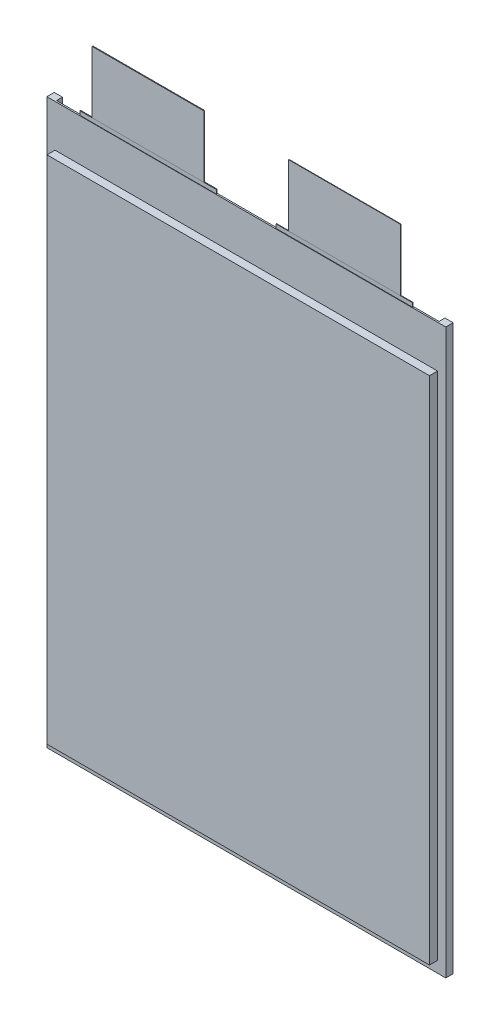
ISO-10303-21;
HEADER;
FILE_DESCRIPTION(('STEP AP214'),'2;1');
FILE_NAME('part.step','',(''),(''),'','','');
FILE_SCHEMA(('AUTOMOTIVE_DESIGN { 1 0 10303 214 1 1 1 1 }'));
ENDSEC;
DATA;
#1=APPLICATION_CONTEXT('core data for automotive mechanical design processes');
#2=APPLICATION_PROTOCOL_DEFINITION('international standard','automotive_design',2000,#1);
#3=PRODUCT_CONTEXT('',#1,'mechanical');
#4=PRODUCT('Part','Part','',(#3));
#5=PRODUCT_RELATED_PRODUCT_CATEGORY('part','',(#4));
#6=PRODUCT_DEFINITION_FORMATION('','',#4);
#7=PRODUCT_DEFINITION_CONTEXT('part definition',#1,'design');
#8=PRODUCT_DEFINITION('design','',#6,#7);
#9=PRODUCT_DEFINITION_SHAPE('','',#8);
#10=(LENGTH_UNIT() NAMED_UNIT(*) SI_UNIT(.MILLI.,.METRE.));
#11=(NAMED_UNIT(*) PLANE_ANGLE_UNIT() SI_UNIT($,.RADIAN.));
#12=(NAMED_UNIT(*) SI_UNIT($,.STERADIAN.) SOLID_ANGLE_UNIT());
#13=UNCERTAINTY_MEASURE_WITH_UNIT(LENGTH_MEASURE(1.E-05),#10,'distance_accuracy_value','');
#14=(GEOMETRIC_REPRESENTATION_CONTEXT(3) GLOBAL_UNCERTAINTY_ASSIGNED_CONTEXT((#13)) GLOBAL_UNIT_ASSIGNED_CONTEXT((#10,
#11,#12)) REPRESENTATION_CONTEXT('',''));
#15=CARTESIAN_POINT('',(0.,0.,0.));
#16=DIRECTION('',(0.,0.,1.));
#17=DIRECTION('',(1.,0.,0.));
#18=AXIS2_PLACEMENT_3D('',#15,#16,#17);
#19=CARTESIAN_POINT('',(-17.2,140.,0.150000000000002));
#20=DIRECTION('',(0.,0.,-1.));
#21=DIRECTION('',(0.,1.,0.));
#22=AXIS2_PLACEMENT_3D('',#19,#20,#21);
#23=PLANE('',#22);
#24=DIRECTION('',(1.,0.,0.));
#25=VECTOR('',#24,1.);
#26=CARTESIAN_POINT('',(-17.2,115.1,0.149999999999997));
#27=LINE('',#26,#25);
#28=CARTESIAN_POINT('',(-62.2,115.1,0.150000000000003));
#29=VERTEX_POINT('',#28);
#30=CARTESIAN_POINT('',(-17.2,115.1,0.149999999999997));
#31=VERTEX_POINT('',#30);
#32=EDGE_CURVE('E141',#29,#31,#27,.T.);
#33=ORIENTED_EDGE('',*,*,#32,.T.);
#34=DIRECTION('',(0.,-1.,0.));
#35=VECTOR('',#34,1.);
#36=CARTESIAN_POINT('',(-17.2,140.,0.150000000000002));
#37=LINE('',#36,#35);
#38=CARTESIAN_POINT('',(-17.2,140.,0.150000000000002));
#39=VERTEX_POINT('',#38);
#40=EDGE_CURVE('E13',#39,#31,#37,.T.);
#41=ORIENTED_EDGE('',*,*,#40,.F.);
#42=DIRECTION('',(1.,0.,0.));
#43=VECTOR('',#42,1.);
#44=CARTESIAN_POINT('',(-17.2,140.,0.150000000000002));
#45=LINE('',#44,#43);
#46=CARTESIAN_POINT('',(-62.2,140.,0.150000000000008));
#47=VERTEX_POINT('',#46);
#48=EDGE_CURVE('E129',#47,#39,#45,.T.);
#49=ORIENTED_EDGE('',*,*,#48,.F.);
#50=DIRECTION('',(0.,-1.,0.));
#51=VECTOR('',#50,1.);
#52=CARTESIAN_POINT('',(-62.2,140.,0.150000000000008));
#53=LINE('',#52,#51);
#54=EDGE_CURVE('E137',#47,#29,#53,.T.);
#55=ORIENTED_EDGE('',*,*,#54,.T.);
#56=EDGE_LOOP('',(#33,#41,#49,#55));
#57=FACE_BOUND('',#56,.T.);
#58=ADVANCED_FACE('F78',(#57),#23,.F.);
#59=CARTESIAN_POINT('',(-17.2,140.,-0.149999999999998));
#60=DIRECTION('',(-1.,0.,0.));
#61=DIRECTION('',(0.,0.,1.));
#62=AXIS2_PLACEMENT_3D('',#59,#60,#61);
#63=PLANE('',#62);
#64=DIRECTION('',(0.,0.,-1.));
#65=VECTOR('',#64,1.);
#66=CARTESIAN_POINT('',(-17.2,115.1,-0.150000000000003));
#67=LINE('',#66,#65);
#68=CARTESIAN_POINT('',(-17.2,115.1,-0.150000000000003));
#69=VERTEX_POINT('',#68);
#70=EDGE_CURVE('E133',#31,#69,#67,.T.);
#71=ORIENTED_EDGE('',*,*,#70,.T.);
#72=DIRECTION('',(0.,-1.,0.));
#73=VECTOR('',#72,1.);
#74=CARTESIAN_POINT('',(-17.2,140.,-0.149999999999998));
#75=LINE('',#74,#73);
#76=CARTESIAN_POINT('',(-17.2,140.,-0.149999999999998));
#77=VERTEX_POINT('',#76);
#78=EDGE_CURVE('E86',#77,#69,#75,.T.);
#79=ORIENTED_EDGE('',*,*,#78,.F.);
#80=DIRECTION('',(0.,0.,-1.));
#81=VECTOR('',#80,1.);
#82=CARTESIAN_POINT('',(-17.2,140.,-0.149999999999998));
#83=LINE('',#82,#81);
#84=EDGE_CURVE('E124',#39,#77,#83,.T.);
#85=ORIENTED_EDGE('',*,*,#84,.F.);
#86=ORIENTED_EDGE('',*,*,#40,.T.);
#87=EDGE_LOOP('',(#71,#79,#85,#86));
#88=FACE_BOUND('',#87,.T.);
#89=ADVANCED_FACE('F132',(#88),#63,.F.);
#90=CARTESIAN_POINT('',(-17.2,140.,-0.149999999999998));
#91=DIRECTION('',(0.,0.,1.));
#92=DIRECTION('',(0.,-1.,0.));
#93=AXIS2_PLACEMENT_3D('',#90,#91,#92);
#94=PLANE('',#93);
#95=DIRECTION('',(-1.,0.,0.));
#96=VECTOR('',#95,1.);
#97=CARTESIAN_POINT('',(-17.2,115.1,-0.150000000000003));
#98=LINE('',#97,#96);
#99=CARTESIAN_POINT('',(-62.2,115.1,-0.149999999999997));
#100=VERTEX_POINT('',#99);
#101=EDGE_CURVE('E111',#69,#100,#98,.T.);
#102=ORIENTED_EDGE('',*,*,#101,.T.);
#103=DIRECTION('',(0.,-1.,0.));
#104=VECTOR('',#103,1.);
#105=CARTESIAN_POINT('',(-62.2,140.,-0.149999999999992));
#106=LINE('',#105,#104);
#107=CARTESIAN_POINT('',(-62.2,140.,-0.149999999999992));
#108=VERTEX_POINT('',#107);
#109=EDGE_CURVE('E134',#108,#100,#106,.T.);
#110=ORIENTED_EDGE('',*,*,#109,.F.);
#111=DIRECTION('',(-1.,0.,0.));
#112=VECTOR('',#111,1.);
#113=CARTESIAN_POINT('',(-17.2,140.,-0.149999999999998));
#114=LINE('',#113,#112);
#115=EDGE_CURVE('E127',#77,#108,#114,.T.);
#116=ORIENTED_EDGE('',*,*,#115,.F.);
#117=ORIENTED_EDGE('',*,*,#78,.T.);
#118=EDGE_LOOP('',(#102,#110,#116,#117));
#119=FACE_BOUND('',#118,.T.);
#120=ADVANCED_FACE('F135',(#119),#94,.F.);
#121=CARTESIAN_POINT('',(-62.2,140.,-0.149999999999992));
#122=DIRECTION('',(1.,0.,0.));
#123=DIRECTION('',(0.,0.,-1.));
#124=AXIS2_PLACEMENT_3D('',#121,#122,#123);
#125=PLANE('',#124);
#126=DIRECTION('',(0.,0.,1.));
#127=VECTOR('',#126,1.);
#128=CARTESIAN_POINT('',(-62.2,115.1,-0.149999999999997));
#129=LINE('',#128,#127);
#130=EDGE_CURVE('E117',#100,#29,#129,.T.);
#131=ORIENTED_EDGE('',*,*,#130,.T.);
#132=ORIENTED_EDGE('',*,*,#54,.F.);
#133=DIRECTION('',(0.,0.,1.));
#134=VECTOR('',#133,1.);
#135=CARTESIAN_POINT('',(-62.2,140.,-0.149999999999992));
#136=LINE('',#135,#134);
#137=EDGE_CURVE('E94',#108,#47,#136,.T.);
#138=ORIENTED_EDGE('',*,*,#137,.F.);
#139=ORIENTED_EDGE('',*,*,#109,.T.);
#140=EDGE_LOOP('',(#131,#132,#138,#139));
#141=FACE_BOUND('',#140,.T.);
#142=ADVANCED_FACE('F148',(#141),#125,.F.);
#143=CARTESIAN_POINT('',(0.,140.,0.));
#144=DIRECTION('',(0.,1.,0.));
#145=DIRECTION('',(0.,0.,1.));
#146=AXIS2_PLACEMENT_3D('',#143,#144,#145);
#147=PLANE('',#146);
#148=ORIENTED_EDGE('',*,*,#48,.T.);
#149=ORIENTED_EDGE('',*,*,#84,.T.);
#150=ORIENTED_EDGE('',*,*,#115,.T.);
#151=ORIENTED_EDGE('',*,*,#137,.T.);
#152=EDGE_LOOP('',(#148,#149,#150,#151));
#153=FACE_BOUND('',#152,.T.);
#154=ADVANCED_FACE('F125',(#153),#147,.T.);
#155=CARTESIAN_POINT('',(0.,115.1,0.));
#156=DIRECTION('',(0.,1.,0.));
#157=DIRECTION('',(0.,0.,1.));
#158=AXIS2_PLACEMENT_3D('',#155,#156,#157);
#159=PLANE('',#158);
#160=ORIENTED_EDGE('',*,*,#32,.F.);
#161=ORIENTED_EDGE('',*,*,#130,.F.);
#162=ORIENTED_EDGE('',*,*,#101,.F.);
#163=ORIENTED_EDGE('',*,*,#70,.F.);
#164=EDGE_LOOP('',(#160,#161,#162,#163));
#165=FACE_BOUND('',#164,.T.);
#166=ADVANCED_FACE('F151',(#165),#159,.F.);
#167=CLOSED_SHELL('',(#58,#89,#120,#142,#154,#166));
#168=MANIFOLD_SOLID_BREP('B2',#167);
#169=CARTESIAN_POINT('',(61.7999999999996,140.,0.0999999999999911));
#170=DIRECTION('',(0.,0.,-1.));
#171=DIRECTION('',(0.,1.,0.));
#172=AXIS2_PLACEMENT_3D('',#169,#170,#171);
#173=PLANE('',#172);
#174=DIRECTION('',(1.,0.,0.));
#175=VECTOR('',#174,1.);
#176=CARTESIAN_POINT('',(61.7999999999996,115.1,0.0999999999999959));
#177=LINE('',#176,#175);
#178=CARTESIAN_POINT('',(16.7999999999996,115.1,0.0999999999999959));
#179=VERTEX_POINT('',#178);
#180=CARTESIAN_POINT('',(61.7999999999996,115.1,0.0999999999999959));
#181=VERTEX_POINT('',#180);
#182=EDGE_CURVE('E286',#179,#181,#177,.T.);
#183=ORIENTED_EDGE('',*,*,#182,.T.);
#184=DIRECTION('',(0.,-1.,0.));
#185=VECTOR('',#184,1.);
#186=CARTESIAN_POINT('',(61.7999999999996,140.,0.0999999999999911));
#187=LINE('',#186,#185);
#188=CARTESIAN_POINT('',(61.7999999999996,140.,0.0999999999999911));
#189=VERTEX_POINT('',#188);
#190=EDGE_CURVE('E76',#189,#181,#187,.T.);
#191=ORIENTED_EDGE('',*,*,#190,.F.);
#192=DIRECTION('',(1.,0.,0.));
#193=VECTOR('',#192,1.);
#194=CARTESIAN_POINT('',(61.7999999999996,140.,0.0999999999999911));
#195=LINE('',#194,#193);
#196=CARTESIAN_POINT('',(16.7999999999996,140.,0.0999999999999911));
#197=VERTEX_POINT('',#196);
#198=EDGE_CURVE('E274',#197,#189,#195,.T.);
#199=ORIENTED_EDGE('',*,*,#198,.F.);
#200=DIRECTION('',(0.,-1.,0.));
#201=VECTOR('',#200,1.);
#202=CARTESIAN_POINT('',(16.7999999999996,140.,0.0999999999999911));
#203=LINE('',#202,#201);
#204=EDGE_CURVE('E282',#197,#179,#203,.T.);
#205=ORIENTED_EDGE('',*,*,#204,.T.);
#206=EDGE_LOOP('',(#183,#191,#199,#205));
#207=FACE_BOUND('',#206,.T.);
#208=ADVANCED_FACE('F223',(#207),#173,.F.);
#209=CARTESIAN_POINT('',(61.7999999999996,140.,-0.100000000000001));
#210=DIRECTION('',(-1.,0.,0.));
#211=DIRECTION('',(0.,0.,1.));
#212=AXIS2_PLACEMENT_3D('',#209,#210,#211);
#213=PLANE('',#212);
#214=DIRECTION('',(0.,0.,-1.));
#215=VECTOR('',#214,1.);
#216=CARTESIAN_POINT('',(61.7999999999996,115.1,-0.0999999999999959));
#217=LINE('',#216,#215);
#218=CARTESIAN_POINT('',(61.7999999999996,115.1,-0.0999999999999959));
#219=VERTEX_POINT('',#218);
#220=EDGE_CURVE('E278',#181,#219,#217,.T.);
#221=ORIENTED_EDGE('',*,*,#220,.T.);
#222=DIRECTION('',(0.,-1.,0.));
#223=VECTOR('',#222,1.);
#224=CARTESIAN_POINT('',(61.7999999999996,140.,-0.100000000000001));
#225=LINE('',#224,#223);
#226=CARTESIAN_POINT('',(61.7999999999996,140.,-0.100000000000001));
#227=VERTEX_POINT('',#226);
#228=EDGE_CURVE('E231',#227,#219,#225,.T.);
#229=ORIENTED_EDGE('',*,*,#228,.F.);
#230=DIRECTION('',(0.,0.,-1.));
#231=VECTOR('',#230,1.);
#232=CARTESIAN_POINT('',(61.7999999999996,140.,-0.100000000000001));
#233=LINE('',#232,#231);
#234=EDGE_CURVE('E269',#189,#227,#233,.T.);
#235=ORIENTED_EDGE('',*,*,#234,.F.);
#236=ORIENTED_EDGE('',*,*,#190,.T.);
#237=EDGE_LOOP('',(#221,#229,#235,#236));
#238=FACE_BOUND('',#237,.T.);
#239=ADVANCED_FACE('F277',(#238),#213,.F.);
#240=CARTESIAN_POINT('',(61.7999999999996,140.,-0.100000000000001));
#241=DIRECTION('',(0.,0.,1.));
#242=DIRECTION('',(0.,-1.,0.));
#243=AXIS2_PLACEMENT_3D('',#240,#241,#242);
#244=PLANE('',#243);
#245=DIRECTION('',(-1.,0.,0.));
#246=VECTOR('',#245,1.);
#247=CARTESIAN_POINT('',(61.7999999999996,115.1,-0.0999999999999959));
#248=LINE('',#247,#246);
#249=CARTESIAN_POINT('',(16.7999999999996,115.1,-0.0999999999999959));
#250=VERTEX_POINT('',#249);
#251=EDGE_CURVE('E256',#219,#250,#248,.T.);
#252=ORIENTED_EDGE('',*,*,#251,.T.);
#253=DIRECTION('',(0.,-1.,0.));
#254=VECTOR('',#253,1.);
#255=CARTESIAN_POINT('',(16.7999999999996,140.,-0.100000000000001));
#256=LINE('',#255,#254);
#257=CARTESIAN_POINT('',(16.7999999999996,140.,-0.100000000000001));
#258=VERTEX_POINT('',#257);
#259=EDGE_CURVE('E279',#258,#250,#256,.T.);
#260=ORIENTED_EDGE('',*,*,#259,.F.);
#261=DIRECTION('',(-1.,0.,0.));
#262=VECTOR('',#261,1.);
#263=CARTESIAN_POINT('',(61.7999999999996,140.,-0.100000000000001));
#264=LINE('',#263,#262);
#265=EDGE_CURVE('E272',#227,#258,#264,.T.);
#266=ORIENTED_EDGE('',*,*,#265,.F.);
#267=ORIENTED_EDGE('',*,*,#228,.T.);
#268=EDGE_LOOP('',(#252,#260,#266,#267));
#269=FACE_BOUND('',#268,.T.);
#270=ADVANCED_FACE('F280',(#269),#244,.F.);
#271=CARTESIAN_POINT('',(16.7999999999996,140.,-0.100000000000001));
#272=DIRECTION('',(1.,0.,0.));
#273=DIRECTION('',(0.,0.,-1.));
#274=AXIS2_PLACEMENT_3D('',#271,#272,#273);
#275=PLANE('',#274);
#276=DIRECTION('',(0.,0.,1.));
#277=VECTOR('',#276,1.);
#278=CARTESIAN_POINT('',(16.7999999999996,115.1,-0.0999999999999959));
#279=LINE('',#278,#277);
#280=EDGE_CURVE('E262',#250,#179,#279,.T.);
#281=ORIENTED_EDGE('',*,*,#280,.T.);
#282=ORIENTED_EDGE('',*,*,#204,.F.);
#283=DIRECTION('',(0.,0.,1.));
#284=VECTOR('',#283,1.);
#285=CARTESIAN_POINT('',(16.7999999999996,140.,-0.100000000000001));
#286=LINE('',#285,#284);
#287=EDGE_CURVE('E239',#258,#197,#286,.T.);
#288=ORIENTED_EDGE('',*,*,#287,.F.);
#289=ORIENTED_EDGE('',*,*,#259,.T.);
#290=EDGE_LOOP('',(#281,#282,#288,#289));
#291=FACE_BOUND('',#290,.T.);
#292=ADVANCED_FACE('F293',(#291),#275,.F.);
#293=CARTESIAN_POINT('',(39.3,140.,39.3));
#294=DIRECTION('',(0.,1.,0.));
#295=DIRECTION('',(1.,0.,0.));
#296=AXIS2_PLACEMENT_3D('',#293,#294,#295);
#297=PLANE('',#296);
#298=ORIENTED_EDGE('',*,*,#198,.T.);
#299=ORIENTED_EDGE('',*,*,#234,.T.);
#300=ORIENTED_EDGE('',*,*,#265,.T.);
#301=ORIENTED_EDGE('',*,*,#287,.T.);
#302=EDGE_LOOP('',(#298,#299,#300,#301));
#303=FACE_BOUND('',#302,.T.);
#304=ADVANCED_FACE('F270',(#303),#297,.T.);
#305=CARTESIAN_POINT('',(39.3,115.1,39.3));
#306=DIRECTION('',(0.,1.,0.));
#307=DIRECTION('',(1.,0.,0.));
#308=AXIS2_PLACEMENT_3D('',#305,#306,#307);
#309=PLANE('',#308);
#310=ORIENTED_EDGE('',*,*,#182,.F.);
#311=ORIENTED_EDGE('',*,*,#280,.F.);
#312=ORIENTED_EDGE('',*,*,#251,.F.);
#313=ORIENTED_EDGE('',*,*,#220,.F.);
#314=EDGE_LOOP('',(#310,#311,#312,#313));
#315=FACE_BOUND('',#314,.T.);
#316=ADVANCED_FACE('F296',(#315),#309,.F.);
#317=CLOSED_SHELL('',(#208,#239,#270,#292,#304,#316));
#318=MANIFOLD_SOLID_BREP('B7',#317);
#319=CARTESIAN_POINT('',(-80.3,113.5,-0.3));
#320=DIRECTION('',(0.,1.,0.));
#321=DIRECTION('',(0.,0.,1.));
#322=AXIS2_PLACEMENT_3D('',#319,#320,#321);
#323=PLANE('',#322);
#324=DIRECTION('',(0.,0.,1.));
#325=VECTOR('',#324,1.);
#326=CARTESIAN_POINT('',(11.8,113.5,-0.3));
#327=LINE('',#326,#325);
#328=CARTESIAN_POINT('',(11.8,113.5,-0.1));
#329=VERTEX_POINT('',#328);
#330=CARTESIAN_POINT('',(11.8,113.5,0.1));
#331=VERTEX_POINT('',#330);
#332=EDGE_CURVE('E721',#329,#331,#327,.T.);
#333=ORIENTED_EDGE('',*,*,#332,.F.);
#334=DIRECTION('',(1.,0.,0.));
#335=VECTOR('',#334,1.);
#336=CARTESIAN_POINT('',(-80.3,113.5,-0.1));
#337=LINE('',#336,#335);
#338=CARTESIAN_POINT('',(66.8,113.5,-0.1));
#339=VERTEX_POINT('',#338);
#340=EDGE_CURVE('E724',#329,#339,#337,.T.);
#341=ORIENTED_EDGE('',*,*,#340,.T.);
#342=DIRECTION('',(0.,0.,1.));
#343=VECTOR('',#342,1.);
#344=CARTESIAN_POINT('',(66.8,113.5,-0.3));
#345=LINE('',#344,#343);
#346=CARTESIAN_POINT('',(66.8,113.5,0.1));
#347=VERTEX_POINT('',#346);
#348=EDGE_CURVE('E719',#339,#347,#345,.T.);
#349=ORIENTED_EDGE('',*,*,#348,.T.);
#350=DIRECTION('',(1.,0.,0.));
#351=VECTOR('',#350,1.);
#352=CARTESIAN_POINT('',(-80.3,113.5,0.1));
#353=LINE('',#352,#351);
#354=EDGE_CURVE('E716',#331,#347,#353,.T.);
#355=ORIENTED_EDGE('',*,*,#354,.F.);
#356=EDGE_LOOP('',(#333,#341,#349,#355));
#357=FACE_BOUND('',#356,.T.);
#358=DIRECTION('',(0.,0.,1.));
#359=VECTOR('',#358,1.);
#360=CARTESIAN_POINT('',(-80.3,113.5,-0.3));
#361=LINE('',#360,#359);
#362=CARTESIAN_POINT('',(-80.3,113.5,-2.66666666666667));
#363=VERTEX_POINT('',#362);
#364=CARTESIAN_POINT('',(-80.3,113.5,0.3));
#365=VERTEX_POINT('',#364);
#366=EDGE_CURVE('E702',#363,#365,#361,.T.);
#367=ORIENTED_EDGE('',*,*,#366,.T.);
#368=DIRECTION('',(-1.,0.,0.));
#369=VECTOR('',#368,1.);
#370=CARTESIAN_POINT('',(-80.3,113.5,0.3));
#371=LINE('',#370,#369);
#372=CARTESIAN_POINT('',(80.3,113.5,0.3));
#373=VERTEX_POINT('',#372);
#374=EDGE_CURVE('E682',#373,#365,#371,.T.);
#375=ORIENTED_EDGE('',*,*,#374,.F.);
#376=DIRECTION('',(0.,0.,1.));
#377=VECTOR('',#376,1.);
#378=CARTESIAN_POINT('',(80.3,113.5,-0.3));
#379=LINE('',#378,#377);
#380=CARTESIAN_POINT('',(80.3,113.5,-2.66666666666667));
#381=VERTEX_POINT('',#380);
#382=EDGE_CURVE('E696',#381,#373,#379,.T.);
#383=ORIENTED_EDGE('',*,*,#382,.F.);
#384=DIRECTION('',(1.,0.,0.));
#385=VECTOR('',#384,1.);
#386=CARTESIAN_POINT('',(0.,113.5,-2.66666666666667));
#387=LINE('',#386,#385);
#388=CARTESIAN_POINT('',(77.,113.5,-2.66666666666667));
#389=VERTEX_POINT('',#388);
#390=EDGE_CURVE('E609',#389,#381,#387,.T.);
#391=ORIENTED_EDGE('',*,*,#390,.F.);
#392=DIRECTION('',(0.,0.,1.));
#393=VECTOR('',#392,1.);
#394=CARTESIAN_POINT('',(77.,113.5,-2.66666666666667));
#395=LINE('',#394,#393);
#396=CARTESIAN_POINT('',(77.,113.5,-0.3));
#397=VERTEX_POINT('',#396);
#398=EDGE_CURVE('E626',#389,#397,#395,.T.);
#399=ORIENTED_EDGE('',*,*,#398,.T.);
#400=DIRECTION('',(-1.,0.,0.));
#401=VECTOR('',#400,1.);
#402=CARTESIAN_POINT('',(-80.3,113.5,-0.3));
#403=LINE('',#402,#401);
#404=CARTESIAN_POINT('',(-77.,113.5,-0.3));
#405=VERTEX_POINT('',#404);
#406=EDGE_CURVE('E691',#397,#405,#403,.T.);
#407=ORIENTED_EDGE('',*,*,#406,.T.);
#408=DIRECTION('',(0.,0.,1.));
#409=VECTOR('',#408,1.);
#410=CARTESIAN_POINT('',(-77.,113.5,-2.66666666666667));
#411=LINE('',#410,#409);
#412=CARTESIAN_POINT('',(-77.,113.5,-2.66666666666667));
#413=VERTEX_POINT('',#412);
#414=EDGE_CURVE('E595',#413,#405,#411,.T.);
#415=ORIENTED_EDGE('',*,*,#414,.F.);
#416=DIRECTION('',(1.,0.,0.));
#417=VECTOR('',#416,1.);
#418=CARTESIAN_POINT('',(0.,113.5,-2.66666666666667));
#419=LINE('',#418,#417);
#420=EDGE_CURVE('E593',#363,#413,#419,.T.);
#421=ORIENTED_EDGE('',*,*,#420,.F.);
#422=EDGE_LOOP('',(#367,#375,#383,#391,#399,#407,#415,#421));
#423=FACE_BOUND('',#422,.T.);
#424=DIRECTION('',(0.,0.,-1.));
#425=VECTOR('',#424,1.);
#426=CARTESIAN_POINT('',(-67.2,113.5,-0.3));
#427=LINE('',#426,#425);
#428=CARTESIAN_POINT('',(-67.2,113.5,0.15));
#429=VERTEX_POINT('',#428);
#430=CARTESIAN_POINT('',(-67.2,113.5,-0.15));
#431=VERTEX_POINT('',#430);
#432=EDGE_CURVE('E377',#429,#431,#427,.T.);
#433=ORIENTED_EDGE('',*,*,#432,.T.);
#434=DIRECTION('',(1.,0.,0.));
#435=VECTOR('',#434,1.);
#436=CARTESIAN_POINT('',(-80.3,113.5,-0.15));
#437=LINE('',#436,#435);
#438=CARTESIAN_POINT('',(-12.2,113.5,-0.15));
#439=VERTEX_POINT('',#438);
#440=EDGE_CURVE('E221',#431,#439,#437,.T.);
#441=ORIENTED_EDGE('',*,*,#440,.T.);
#442=DIRECTION('',(0.,0.,-1.));
#443=VECTOR('',#442,1.);
#444=CARTESIAN_POINT('',(-12.2,113.5,-0.3));
#445=LINE('',#444,#443);
#446=CARTESIAN_POINT('',(-12.2,113.5,0.15));
#447=VERTEX_POINT('',#446);
#448=EDGE_CURVE('E367',#447,#439,#445,.T.);
#449=ORIENTED_EDGE('',*,*,#448,.F.);
#450=DIRECTION('',(1.,0.,0.));
#451=VECTOR('',#450,1.);
#452=CARTESIAN_POINT('',(-80.3,113.5,0.15));
#453=LINE('',#452,#451);
#454=EDGE_CURVE('E726',#429,#447,#453,.T.);
#455=ORIENTED_EDGE('',*,*,#454,.F.);
#456=EDGE_LOOP('',(#433,#441,#449,#455));
#457=FACE_BOUND('',#456,.T.);
#458=ADVANCED_FACE('F359',(#357,#423,#457),#323,.T.);
#459=CARTESIAN_POINT('',(0.,0.,-0.3));
#460=DIRECTION('',(0.,0.,-1.));
#461=DIRECTION('',(-1.,0.,0.));
#462=AXIS2_PLACEMENT_3D('',#459,#460,#461);
#463=PLANE('',#462);
#464=DIRECTION('',(1.,0.,0.));
#465=VECTOR('',#464,1.);
#466=CARTESIAN_POINT('',(-80.3,-113.5,-0.3));
#467=LINE('',#466,#465);
#468=CARTESIAN_POINT('',(-77.,-113.5,-0.3));
#469=VERTEX_POINT('',#468);
#470=CARTESIAN_POINT('',(77.,-113.5,-0.3));
#471=VERTEX_POINT('',#470);
#472=EDGE_CURVE('E694',#469,#471,#467,.T.);
#473=ORIENTED_EDGE('',*,*,#472,.F.);
#474=DIRECTION('',(0.,-1.,0.));
#475=VECTOR('',#474,1.);
#476=CARTESIAN_POINT('',(-77.,0.,-0.3));
#477=LINE('',#476,#475);
#478=CARTESIAN_POINT('',(-77.,-109.,-0.3));
#479=VERTEX_POINT('',#478);
#480=EDGE_CURVE('E580',#479,#469,#477,.T.);
#481=ORIENTED_EDGE('',*,*,#480,.F.);
#482=DIRECTION('',(-1.,0.,0.));
#483=VECTOR('',#482,1.);
#484=CARTESIAN_POINT('',(0.,-109.,-0.3));
#485=LINE('',#484,#483);
#486=CARTESIAN_POINT('',(77.,-109.,-0.3));
#487=VERTEX_POINT('',#486);
#488=EDGE_CURVE('E676',#487,#479,#485,.T.);
#489=ORIENTED_EDGE('',*,*,#488,.F.);
#490=DIRECTION('',(0.,-1.,0.));
#491=VECTOR('',#490,1.);
#492=CARTESIAN_POINT('',(77.,0.,-0.3));
#493=LINE('',#492,#491);
#494=EDGE_CURVE('E605',#487,#471,#493,.T.);
#495=ORIENTED_EDGE('',*,*,#494,.T.);
#496=EDGE_LOOP('',(#473,#481,#489,#495));
#497=FACE_BOUND('',#496,.T.);
#498=ADVANCED_FACE('F743',(#497),#463,.T.);
#499=DIRECTION('',(1.,0.,0.));
#500=VECTOR('',#499,1.);
#501=CARTESIAN_POINT('',(0.,96.5,-0.3));
#502=LINE('',#501,#500);
#503=CARTESIAN_POINT('',(-77.,96.5,-0.3));
#504=VERTEX_POINT('',#503);
#505=CARTESIAN_POINT('',(77.,96.5,-0.3));
#506=VERTEX_POINT('',#505);
#507=EDGE_CURVE('E660',#504,#506,#502,.T.);
#508=ORIENTED_EDGE('',*,*,#507,.F.);
#509=EDGE_CURVE('E596',#405,#504,#477,.T.);
#510=ORIENTED_EDGE('',*,*,#509,.F.);
#511=ORIENTED_EDGE('',*,*,#406,.F.);
#512=EDGE_CURVE('E621',#397,#506,#493,.T.);
#513=ORIENTED_EDGE('',*,*,#512,.T.);
#514=EDGE_LOOP('',(#508,#510,#511,#513));
#515=FACE_BOUND('',#514,.T.);
#516=ADVANCED_FACE('F748',(#515),#463,.T.);
#517=CARTESIAN_POINT('',(80.3,-113.5,-0.3));
#518=DIRECTION('',(1.,0.,0.));
#519=DIRECTION('',(0.,0.,-1.));
#520=AXIS2_PLACEMENT_3D('',#517,#518,#519);
#521=PLANE('',#520);
#522=ORIENTED_EDGE('',*,*,#382,.T.);
#523=DIRECTION('',(0.,1.,0.));
#524=VECTOR('',#523,1.);
#525=CARTESIAN_POINT('',(80.3,-113.5,0.3));
#526=LINE('',#525,#524);
#527=CARTESIAN_POINT('',(80.3,-113.5,0.3));
#528=VERTEX_POINT('',#527);
#529=EDGE_CURVE('E679',#528,#373,#526,.T.);
#530=ORIENTED_EDGE('',*,*,#529,.F.);
#531=DIRECTION('',(0.,0.,1.));
#532=VECTOR('',#531,1.);
#533=CARTESIAN_POINT('',(80.3,-113.5,-0.3));
#534=LINE('',#533,#532);
#535=CARTESIAN_POINT('',(80.3,-113.5,-2.66666666666667));
#536=VERTEX_POINT('',#535);
#537=EDGE_CURVE('E697',#536,#528,#534,.T.);
#538=ORIENTED_EDGE('',*,*,#537,.F.);
#539=DIRECTION('',(0.,-1.,0.));
#540=VECTOR('',#539,1.);
#541=CARTESIAN_POINT('',(80.3,0.,-2.66666666666667));
#542=LINE('',#541,#540);
#543=EDGE_CURVE('E614',#381,#536,#542,.T.);
#544=ORIENTED_EDGE('',*,*,#543,.F.);
#545=EDGE_LOOP('',(#522,#530,#538,#544));
#546=FACE_BOUND('',#545,.T.);
#547=ADVANCED_FACE('F361',(#546),#521,.T.);
#548=CARTESIAN_POINT('',(-80.3,-113.5,-0.3));
#549=DIRECTION('',(0.,-1.,0.));
#550=DIRECTION('',(0.,0.,-1.));
#551=AXIS2_PLACEMENT_3D('',#548,#549,#550);
#552=PLANE('',#551);
#553=ORIENTED_EDGE('',*,*,#537,.T.);
#554=DIRECTION('',(1.,0.,0.));
#555=VECTOR('',#554,1.);
#556=CARTESIAN_POINT('',(-80.3,-113.5,0.3));
#557=LINE('',#556,#555);
#558=CARTESIAN_POINT('',(-80.3,-113.5,0.3));
#559=VERTEX_POINT('',#558);
#560=EDGE_CURVE('E688',#559,#528,#557,.T.);
#561=ORIENTED_EDGE('',*,*,#560,.F.);
#562=DIRECTION('',(0.,0.,1.));
#563=VECTOR('',#562,1.);
#564=CARTESIAN_POINT('',(-80.3,-113.5,-0.3));
#565=LINE('',#564,#563);
#566=CARTESIAN_POINT('',(-80.3,-113.5,-2.66666666666667));
#567=VERTEX_POINT('',#566);
#568=EDGE_CURVE('E700',#567,#559,#565,.T.);
#569=ORIENTED_EDGE('',*,*,#568,.F.);
#570=DIRECTION('',(-1.,0.,0.));
#571=VECTOR('',#570,1.);
#572=CARTESIAN_POINT('',(0.,-113.5,-2.66666666666667));
#573=LINE('',#572,#571);
#574=CARTESIAN_POINT('',(-77.,-113.5,-2.66666666666667));
#575=VERTEX_POINT('',#574);
#576=EDGE_CURVE('E585',#575,#567,#573,.T.);
#577=ORIENTED_EDGE('',*,*,#576,.F.);
#578=DIRECTION('',(0.,0.,1.));
#579=VECTOR('',#578,1.);
#580=CARTESIAN_POINT('',(-77.,-113.5,-2.66666666666667));
#581=LINE('',#580,#579);
#582=EDGE_CURVE('E599',#575,#469,#581,.T.);
#583=ORIENTED_EDGE('',*,*,#582,.T.);
#584=ORIENTED_EDGE('',*,*,#472,.T.);
#585=DIRECTION('',(0.,0.,1.));
#586=VECTOR('',#585,1.);
#587=CARTESIAN_POINT('',(77.,-113.5,-2.66666666666667));
#588=LINE('',#587,#586);
#589=CARTESIAN_POINT('',(77.,-113.5,-2.66666666666667));
#590=VERTEX_POINT('',#589);
#591=EDGE_CURVE('E620',#590,#471,#588,.T.);
#592=ORIENTED_EDGE('',*,*,#591,.F.);
#593=DIRECTION('',(-1.,0.,0.));
#594=VECTOR('',#593,1.);
#595=CARTESIAN_POINT('',(0.,-113.5,-2.66666666666667));
#596=LINE('',#595,#594);
#597=EDGE_CURVE('E617',#536,#590,#596,.T.);
#598=ORIENTED_EDGE('',*,*,#597,.F.);
#599=EDGE_LOOP('',(#553,#561,#569,#577,#583,#584,#592,#598));
#600=FACE_BOUND('',#599,.T.);
#601=ADVANCED_FACE('F757',(#600),#552,.T.);
#602=CARTESIAN_POINT('',(-80.3,-113.5,-0.3));
#603=DIRECTION('',(-1.,0.,0.));
#604=DIRECTION('',(0.,0.,1.));
#605=AXIS2_PLACEMENT_3D('',#602,#603,#604);
#606=PLANE('',#605);
#607=ORIENTED_EDGE('',*,*,#568,.T.);
#608=DIRECTION('',(0.,-1.,0.));
#609=VECTOR('',#608,1.);
#610=CARTESIAN_POINT('',(-80.3,-113.5,0.3));
#611=LINE('',#610,#609);
#612=EDGE_CURVE('E685',#365,#559,#611,.T.);
#613=ORIENTED_EDGE('',*,*,#612,.F.);
#614=ORIENTED_EDGE('',*,*,#366,.F.);
#615=DIRECTION('',(0.,1.,0.));
#616=VECTOR('',#615,1.);
#617=CARTESIAN_POINT('',(-80.3,0.,-2.66666666666667));
#618=LINE('',#617,#616);
#619=EDGE_CURVE('E590',#567,#363,#618,.T.);
#620=ORIENTED_EDGE('',*,*,#619,.F.);
#621=EDGE_LOOP('',(#607,#613,#614,#620));
#622=FACE_BOUND('',#621,.T.);
#623=ADVANCED_FACE('F753',(#622),#606,.T.);
#624=CARTESIAN_POINT('',(0.,0.,0.3));
#625=DIRECTION('',(0.,0.,-1.));
#626=DIRECTION('',(-1.,0.,0.));
#627=AXIS2_PLACEMENT_3D('',#624,#625,#626);
#628=PLANE('',#627);
#629=DIRECTION('',(1.,0.,0.));
#630=VECTOR('',#629,1.);
#631=CARTESIAN_POINT('',(0.,96.5,0.3));
#632=LINE('',#631,#630);
#633=CARTESIAN_POINT('',(-77.,96.5,0.3));
#634=VERTEX_POINT('',#633);
#635=CARTESIAN_POINT('',(77.,96.5,0.3));
#636=VERTEX_POINT('',#635);
#637=EDGE_CURVE('E699',#634,#636,#632,.T.);
#638=ORIENTED_EDGE('',*,*,#637,.T.);
#639=DIRECTION('',(0.,-1.,0.));
#640=VECTOR('',#639,1.);
#641=CARTESIAN_POINT('',(77.,0.,0.3));
#642=LINE('',#641,#640);
#643=CARTESIAN_POINT('',(77.,-109.,0.3));
#644=VERTEX_POINT('',#643);
#645=EDGE_CURVE('E713',#636,#644,#642,.T.);
#646=ORIENTED_EDGE('',*,*,#645,.T.);
#647=DIRECTION('',(-1.,0.,0.));
#648=VECTOR('',#647,1.);
#649=CARTESIAN_POINT('',(0.,-109.,0.3));
#650=LINE('',#649,#648);
#651=CARTESIAN_POINT('',(-77.,-109.,0.3));
#652=VERTEX_POINT('',#651);
#653=EDGE_CURVE('E710',#644,#652,#650,.T.);
#654=ORIENTED_EDGE('',*,*,#653,.T.);
#655=DIRECTION('',(0.,1.,0.));
#656=VECTOR('',#655,1.);
#657=CARTESIAN_POINT('',(-77.,0.,0.3));
#658=LINE('',#657,#656);
#659=EDGE_CURVE('E707',#652,#634,#658,.T.);
#660=ORIENTED_EDGE('',*,*,#659,.T.);
#661=EDGE_LOOP('',(#638,#646,#654,#660));
#662=FACE_BOUND('',#661,.T.);
#663=ORIENTED_EDGE('',*,*,#529,.T.);
#664=ORIENTED_EDGE('',*,*,#374,.T.);
#665=ORIENTED_EDGE('',*,*,#612,.T.);
#666=ORIENTED_EDGE('',*,*,#560,.T.);
#667=EDGE_LOOP('',(#663,#664,#665,#666));
#668=FACE_BOUND('',#667,.T.);
#669=ADVANCED_FACE('F756',(#662,#668),#628,.F.);
#670=CARTESIAN_POINT('',(0.,0.,3.55));
#671=DIRECTION('',(0.,0.,-1.));
#672=DIRECTION('',(-1.,0.,0.));
#673=AXIS2_PLACEMENT_3D('',#670,#671,#672);
#674=PLANE('',#673);
#675=DIRECTION('',(0.,1.,0.));
#676=VECTOR('',#675,1.);
#677=CARTESIAN_POINT('',(77.,-109.,3.55));
#678=LINE('',#677,#676);
#679=CARTESIAN_POINT('',(77.,-109.,3.55));
#680=VERTEX_POINT('',#679);
#681=CARTESIAN_POINT('',(77.,96.5,3.55));
#682=VERTEX_POINT('',#681);
#683=EDGE_CURVE('E632',#680,#682,#678,.T.);
#684=ORIENTED_EDGE('',*,*,#683,.T.);
#685=DIRECTION('',(-1.,0.,0.));
#686=VECTOR('',#685,1.);
#687=CARTESIAN_POINT('',(-77.,96.5,3.55));
#688=LINE('',#687,#686);
#689=CARTESIAN_POINT('',(-77.,96.5,3.55));
#690=VERTEX_POINT('',#689);
#691=EDGE_CURVE('E635',#682,#690,#688,.T.);
#692=ORIENTED_EDGE('',*,*,#691,.T.);
#693=DIRECTION('',(0.,-1.,0.));
#694=VECTOR('',#693,1.);
#695=CARTESIAN_POINT('',(-77.,-109.,3.55));
#696=LINE('',#695,#694);
#697=CARTESIAN_POINT('',(-77.,-109.,3.55));
#698=VERTEX_POINT('',#697);
#699=EDGE_CURVE('E638',#690,#698,#696,.T.);
#700=ORIENTED_EDGE('',*,*,#699,.T.);
#701=DIRECTION('',(1.,0.,0.));
#702=VECTOR('',#701,1.);
#703=CARTESIAN_POINT('',(-77.,-109.,3.55));
#704=LINE('',#703,#702);
#705=EDGE_CURVE('E641',#698,#680,#704,.T.);
#706=ORIENTED_EDGE('',*,*,#705,.T.);
#707=EDGE_LOOP('',(#684,#692,#700,#706));
#708=FACE_BOUND('',#707,.T.);
#709=ADVANCED_FACE('F764',(#708),#674,.F.);
#710=CARTESIAN_POINT('',(-77.,96.5,-3.55));
#711=DIRECTION('',(0.,1.,0.));
#712=DIRECTION('',(-1.,0.,0.));
#713=AXIS2_PLACEMENT_3D('',#710,#711,#712);
#714=PLANE('',#713);
#715=ORIENTED_EDGE('',*,*,#637,.F.);
#716=DIRECTION('',(0.,0.,1.));
#717=VECTOR('',#716,1.);
#718=CARTESIAN_POINT('',(-77.,96.5,-3.55));
#719=LINE('',#718,#717);
#720=EDGE_CURVE('E670',#634,#690,#719,.T.);
#721=ORIENTED_EDGE('',*,*,#720,.T.);
#722=ORIENTED_EDGE('',*,*,#691,.F.);
#723=DIRECTION('',(0.,0.,1.));
#724=VECTOR('',#723,1.);
#725=CARTESIAN_POINT('',(77.,96.5,-3.55));
#726=LINE('',#725,#724);
#727=EDGE_CURVE('E656',#636,#682,#726,.T.);
#728=ORIENTED_EDGE('',*,*,#727,.F.);
#729=EDGE_LOOP('',(#715,#721,#722,#728));
#730=FACE_BOUND('',#729,.T.);
#731=ADVANCED_FACE('F778',(#730),#714,.T.);
#732=CARTESIAN_POINT('',(-77.,-109.,-3.55));
#733=DIRECTION('',(-1.,0.,0.));
#734=DIRECTION('',(0.,0.,1.));
#735=AXIS2_PLACEMENT_3D('',#732,#733,#734);
#736=PLANE('',#735);
#737=ORIENTED_EDGE('',*,*,#659,.F.);
#738=DIRECTION('',(0.,0.,1.));
#739=VECTOR('',#738,1.);
#740=CARTESIAN_POINT('',(-77.,-109.,-3.55));
#741=LINE('',#740,#739);
#742=EDGE_CURVE('E665',#652,#698,#741,.T.);
#743=ORIENTED_EDGE('',*,*,#742,.T.);
#744=ORIENTED_EDGE('',*,*,#699,.F.);
#745=ORIENTED_EDGE('',*,*,#720,.F.);
#746=EDGE_LOOP('',(#737,#743,#744,#745));
#747=FACE_BOUND('',#746,.T.);
#748=ADVANCED_FACE('F782',(#747),#736,.T.);
#749=CARTESIAN_POINT('',(-77.,-109.,-3.55));
#750=DIRECTION('',(0.,-1.,0.));
#751=DIRECTION('',(0.,0.,-1.));
#752=AXIS2_PLACEMENT_3D('',#749,#750,#751);
#753=PLANE('',#752);
#754=ORIENTED_EDGE('',*,*,#653,.F.);
#755=DIRECTION('',(0.,0.,1.));
#756=VECTOR('',#755,1.);
#757=CARTESIAN_POINT('',(77.,-109.,-3.55));
#758=LINE('',#757,#756);
#759=EDGE_CURVE('E661',#644,#680,#758,.T.);
#760=ORIENTED_EDGE('',*,*,#759,.T.);
#761=ORIENTED_EDGE('',*,*,#705,.F.);
#762=ORIENTED_EDGE('',*,*,#742,.F.);
#763=EDGE_LOOP('',(#754,#760,#761,#762));
#764=FACE_BOUND('',#763,.T.);
#765=ADVANCED_FACE('F786',(#764),#753,.T.);
#766=CARTESIAN_POINT('',(77.,-109.,-3.55));
#767=DIRECTION('',(1.,0.,0.));
#768=DIRECTION('',(0.,0.,-1.));
#769=AXIS2_PLACEMENT_3D('',#766,#767,#768);
#770=PLANE('',#769);
#771=ORIENTED_EDGE('',*,*,#645,.F.);
#772=ORIENTED_EDGE('',*,*,#727,.T.);
#773=ORIENTED_EDGE('',*,*,#683,.F.);
#774=ORIENTED_EDGE('',*,*,#759,.F.);
#775=EDGE_LOOP('',(#771,#772,#773,#774));
#776=FACE_BOUND('',#775,.T.);
#777=ADVANCED_FACE('F770',(#776),#770,.T.);
#778=DIRECTION('',(0.,-1.,0.));
#779=VECTOR('',#778,1.);
#780=CARTESIAN_POINT('',(77.,0.,-2.66666666666667));
#781=LINE('',#780,#779);
#782=CARTESIAN_POINT('',(77.,96.5,-2.66666666666667));
#783=VERTEX_POINT('',#782);
#784=CARTESIAN_POINT('',(77.,-109.,-2.66666666666667));
#785=VERTEX_POINT('',#784);
#786=EDGE_CURVE('E610',#783,#785,#781,.T.);
#787=ORIENTED_EDGE('',*,*,#786,.T.);
#788=CARTESIAN_POINT('',(77.,-109.,-3.55));
#789=VERTEX_POINT('',#788);
#790=EDGE_CURVE('E657',#789,#785,#758,.T.);
#791=ORIENTED_EDGE('',*,*,#790,.F.);
#792=DIRECTION('',(0.,1.,0.));
#793=VECTOR('',#792,1.);
#794=CARTESIAN_POINT('',(77.,-109.,-3.55));
#795=LINE('',#794,#793);
#796=CARTESIAN_POINT('',(77.,96.5,-3.55));
#797=VERTEX_POINT('',#796);
#798=EDGE_CURVE('E644',#789,#797,#795,.T.);
#799=ORIENTED_EDGE('',*,*,#798,.T.);
#800=EDGE_CURVE('E671',#797,#783,#726,.T.);
#801=ORIENTED_EDGE('',*,*,#800,.T.);
#802=EDGE_LOOP('',(#787,#791,#799,#801));
#803=FACE_BOUND('',#802,.T.);
#804=ADVANCED_FACE('F766',(#803),#770,.T.);
#805=ORIENTED_EDGE('',*,*,#790,.T.);
#806=DIRECTION('',(0.,0.,-1.));
#807=VECTOR('',#806,1.);
#808=CARTESIAN_POINT('',(77.,-109.,-3.55));
#809=LINE('',#808,#807);
#810=EDGE_CURVE('E629',#487,#785,#809,.T.);
#811=ORIENTED_EDGE('',*,*,#810,.F.);
#812=ORIENTED_EDGE('',*,*,#488,.T.);
#813=DIRECTION('',(0.,0.,-1.));
#814=VECTOR('',#813,1.);
#815=CARTESIAN_POINT('',(-77.,-109.,-3.55));
#816=LINE('',#815,#814);
#817=CARTESIAN_POINT('',(-77.,-109.,-2.66666666666667));
#818=VERTEX_POINT('',#817);
#819=EDGE_CURVE('E602',#479,#818,#816,.T.);
#820=ORIENTED_EDGE('',*,*,#819,.T.);
#821=CARTESIAN_POINT('',(-77.,-109.,-3.55));
#822=VERTEX_POINT('',#821);
#823=EDGE_CURVE('E662',#822,#818,#741,.T.);
#824=ORIENTED_EDGE('',*,*,#823,.F.);
#825=DIRECTION('',(1.,0.,0.));
#826=VECTOR('',#825,1.);
#827=CARTESIAN_POINT('',(-77.,-109.,-3.55));
#828=LINE('',#827,#826);
#829=EDGE_CURVE('E653',#822,#789,#828,.T.);
#830=ORIENTED_EDGE('',*,*,#829,.T.);
#831=EDGE_LOOP('',(#805,#811,#812,#820,#824,#830));
#832=FACE_BOUND('',#831,.T.);
#833=ADVANCED_FACE('F769',(#832),#753,.T.);
#834=DIRECTION('',(0.,-1.,0.));
#835=VECTOR('',#834,1.);
#836=CARTESIAN_POINT('',(-77.,0.,-2.66666666666667));
#837=LINE('',#836,#835);
#838=CARTESIAN_POINT('',(-77.,96.5,-2.66666666666667));
#839=VERTEX_POINT('',#838);
#840=EDGE_CURVE('E586',#839,#818,#837,.T.);
#841=ORIENTED_EDGE('',*,*,#840,.F.);
#842=CARTESIAN_POINT('',(-77.,96.5,-3.55));
#843=VERTEX_POINT('',#842);
#844=EDGE_CURVE('E666',#843,#839,#719,.T.);
#845=ORIENTED_EDGE('',*,*,#844,.F.);
#846=DIRECTION('',(0.,-1.,0.));
#847=VECTOR('',#846,1.);
#848=CARTESIAN_POINT('',(-77.,-109.,-3.55));
#849=LINE('',#848,#847);
#850=EDGE_CURVE('E650',#843,#822,#849,.T.);
#851=ORIENTED_EDGE('',*,*,#850,.T.);
#852=ORIENTED_EDGE('',*,*,#823,.T.);
#853=EDGE_LOOP('',(#841,#845,#851,#852));
#854=FACE_BOUND('',#853,.T.);
#855=ADVANCED_FACE('F776',(#854),#736,.T.);
#856=ORIENTED_EDGE('',*,*,#844,.T.);
#857=EDGE_CURVE('E669',#839,#504,#719,.T.);
#858=ORIENTED_EDGE('',*,*,#857,.T.);
#859=ORIENTED_EDGE('',*,*,#507,.T.);
#860=EDGE_CURVE('E674',#783,#506,#726,.T.);
#861=ORIENTED_EDGE('',*,*,#860,.F.);
#862=ORIENTED_EDGE('',*,*,#800,.F.);
#863=DIRECTION('',(-1.,0.,0.));
#864=VECTOR('',#863,1.);
#865=CARTESIAN_POINT('',(-77.,96.5,-3.55));
#866=LINE('',#865,#864);
#867=EDGE_CURVE('E647',#797,#843,#866,.T.);
#868=ORIENTED_EDGE('',*,*,#867,.T.);
#869=EDGE_LOOP('',(#856,#858,#859,#861,#862,#868));
#870=FACE_BOUND('',#869,.T.);
#871=ADVANCED_FACE('F772',(#870),#714,.T.);
#872=CARTESIAN_POINT('',(0.,0.,-3.55));
#873=DIRECTION('',(0.,0.,-1.));
#874=DIRECTION('',(-1.,0.,0.));
#875=AXIS2_PLACEMENT_3D('',#872,#873,#874);
#876=PLANE('',#875);
#877=ORIENTED_EDGE('',*,*,#798,.F.);
#878=ORIENTED_EDGE('',*,*,#829,.F.);
#879=ORIENTED_EDGE('',*,*,#850,.F.);
#880=ORIENTED_EDGE('',*,*,#867,.F.);
#881=EDGE_LOOP('',(#877,#878,#879,#880));
#882=FACE_BOUND('',#881,.T.);
#883=ADVANCED_FACE('F775',(#882),#876,.T.);
#884=CARTESIAN_POINT('',(77.,0.,-2.66666666666667));
#885=DIRECTION('',(-1.,0.,0.));
#886=DIRECTION('',(0.,0.,1.));
#887=AXIS2_PLACEMENT_3D('',#884,#885,#886);
#888=PLANE('',#887);
#889=ORIENTED_EDGE('',*,*,#494,.F.);
#890=ORIENTED_EDGE('',*,*,#810,.T.);
#891=EDGE_CURVE('E611',#785,#590,#781,.T.);
#892=ORIENTED_EDGE('',*,*,#891,.T.);
#893=ORIENTED_EDGE('',*,*,#591,.T.);
#894=EDGE_LOOP('',(#889,#890,#892,#893));
#895=FACE_BOUND('',#894,.T.);
#896=ADVANCED_FACE('F789',(#895),#888,.T.);
#897=EDGE_CURVE('E606',#389,#783,#781,.T.);
#898=ORIENTED_EDGE('',*,*,#897,.T.);
#899=ORIENTED_EDGE('',*,*,#860,.T.);
#900=ORIENTED_EDGE('',*,*,#512,.F.);
#901=ORIENTED_EDGE('',*,*,#398,.F.);
#902=EDGE_LOOP('',(#898,#899,#900,#901));
#903=FACE_BOUND('',#902,.T.);
#904=ADVANCED_FACE('F794',(#903),#888,.T.);
#905=CARTESIAN_POINT('',(0.,0.,-2.66666666666667));
#906=DIRECTION('',(0.,0.,-1.));
#907=DIRECTION('',(-1.,0.,0.));
#908=AXIS2_PLACEMENT_3D('',#905,#906,#907);
#909=PLANE('',#908);
#910=ORIENTED_EDGE('',*,*,#897,.F.);
#911=ORIENTED_EDGE('',*,*,#390,.T.);
#912=ORIENTED_EDGE('',*,*,#543,.T.);
#913=ORIENTED_EDGE('',*,*,#597,.T.);
#914=ORIENTED_EDGE('',*,*,#891,.F.);
#915=ORIENTED_EDGE('',*,*,#786,.F.);
#916=EDGE_LOOP('',(#910,#911,#912,#913,#914,#915));
#917=FACE_BOUND('',#916,.T.);
#918=ADVANCED_FACE('F797',(#917),#909,.T.);
#919=CARTESIAN_POINT('',(-77.,0.,-2.66666666666667));
#920=DIRECTION('',(-1.,0.,0.));
#921=DIRECTION('',(0.,0.,1.));
#922=AXIS2_PLACEMENT_3D('',#919,#920,#921);
#923=PLANE('',#922);
#924=ORIENTED_EDGE('',*,*,#819,.F.);
#925=ORIENTED_EDGE('',*,*,#480,.T.);
#926=ORIENTED_EDGE('',*,*,#582,.F.);
#927=EDGE_CURVE('E587',#818,#575,#837,.T.);
#928=ORIENTED_EDGE('',*,*,#927,.F.);
#929=EDGE_LOOP('',(#924,#925,#926,#928));
#930=FACE_BOUND('',#929,.T.);
#931=ADVANCED_FACE('F801',(#930),#923,.F.);
#932=ORIENTED_EDGE('',*,*,#857,.F.);
#933=EDGE_CURVE('E582',#413,#839,#837,.T.);
#934=ORIENTED_EDGE('',*,*,#933,.F.);
#935=ORIENTED_EDGE('',*,*,#414,.T.);
#936=ORIENTED_EDGE('',*,*,#509,.T.);
#937=EDGE_LOOP('',(#932,#934,#935,#936));
#938=FACE_BOUND('',#937,.T.);
#939=ADVANCED_FACE('F803',(#938),#923,.F.);
#940=CARTESIAN_POINT('',(0.,0.,-2.66666666666667));
#941=DIRECTION('',(0.,0.,-1.));
#942=DIRECTION('',(-1.,0.,0.));
#943=AXIS2_PLACEMENT_3D('',#940,#941,#942);
#944=PLANE('',#943);
#945=ORIENTED_EDGE('',*,*,#933,.T.);
#946=ORIENTED_EDGE('',*,*,#840,.T.);
#947=ORIENTED_EDGE('',*,*,#927,.T.);
#948=ORIENTED_EDGE('',*,*,#576,.T.);
#949=ORIENTED_EDGE('',*,*,#619,.T.);
#950=ORIENTED_EDGE('',*,*,#420,.T.);
#951=EDGE_LOOP('',(#945,#946,#947,#948,#949,#950));
#952=FACE_BOUND('',#951,.T.);
#953=ADVANCED_FACE('F806',(#952),#944,.T.);
#954=CARTESIAN_POINT('',(11.8,0.,-0.1));
#955=DIRECTION('',(-1.,0.,0.));
#956=DIRECTION('',(0.,0.,1.));
#957=AXIS2_PLACEMENT_3D('',#954,#955,#956);
#958=PLANE('',#957);
#959=DIRECTION('',(0.,-1.,0.));
#960=VECTOR('',#959,1.);
#961=CARTESIAN_POINT('',(11.8,0.,-0.1));
#962=LINE('',#961,#960);
#963=CARTESIAN_POINT('',(11.8,115.1,-0.1));
#964=VERTEX_POINT('',#963);
#965=EDGE_CURVE('E569',#964,#329,#962,.T.);
#966=ORIENTED_EDGE('',*,*,#965,.T.);
#967=ORIENTED_EDGE('',*,*,#332,.T.);
#968=DIRECTION('',(0.,-1.,0.));
#969=VECTOR('',#968,1.);
#970=CARTESIAN_POINT('',(11.8,0.,0.1));
#971=LINE('',#970,#969);
#972=CARTESIAN_POINT('',(11.8,115.1,0.1));
#973=VERTEX_POINT('',#972);
#974=EDGE_CURVE('E559',#973,#331,#971,.T.);
#975=ORIENTED_EDGE('',*,*,#974,.F.);
#976=DIRECTION('',(0.,0.,1.));
#977=VECTOR('',#976,1.);
#978=CARTESIAN_POINT('',(11.8,115.1,-0.1));
#979=LINE('',#978,#977);
#980=EDGE_CURVE('E578',#964,#973,#979,.T.);
#981=ORIENTED_EDGE('',*,*,#980,.F.);
#982=EDGE_LOOP('',(#966,#967,#975,#981));
#983=FACE_BOUND('',#982,.T.);
#984=ADVANCED_FACE('F810',(#983),#958,.T.);
#985=CARTESIAN_POINT('',(0.,115.1,-0.1));
#986=DIRECTION('',(0.,-1.,0.));
#987=DIRECTION('',(0.,0.,-1.));
#988=AXIS2_PLACEMENT_3D('',#985,#986,#987);
#989=PLANE('',#988);
#990=ORIENTED_EDGE('',*,*,#980,.T.);
#991=DIRECTION('',(1.,0.,0.));
#992=VECTOR('',#991,1.);
#993=CARTESIAN_POINT('',(0.,115.1,0.1));
#994=LINE('',#993,#992);
#995=CARTESIAN_POINT('',(66.8,115.1,0.1));
#996=VERTEX_POINT('',#995);
#997=EDGE_CURVE('E566',#973,#996,#994,.T.);
#998=ORIENTED_EDGE('',*,*,#997,.T.);
#999=DIRECTION('',(0.,0.,1.));
#1000=VECTOR('',#999,1.);
#1001=CARTESIAN_POINT('',(66.8,115.1,-0.1));
#1002=LINE('',#1001,#1000);
#1003=CARTESIAN_POINT('',(66.8,115.1,-0.1));
#1004=VERTEX_POINT('',#1003);
#1005=EDGE_CURVE('E577',#1004,#996,#1002,.T.);
#1006=ORIENTED_EDGE('',*,*,#1005,.F.);
#1007=DIRECTION('',(1.,0.,0.));
#1008=VECTOR('',#1007,1.);
#1009=CARTESIAN_POINT('',(0.,115.1,-0.1));
#1010=LINE('',#1009,#1008);
#1011=EDGE_CURVE('E575',#964,#1004,#1010,.T.);
#1012=ORIENTED_EDGE('',*,*,#1011,.F.);
#1013=EDGE_LOOP('',(#990,#998,#1006,#1012));
#1014=FACE_BOUND('',#1013,.T.);
#1015=ADVANCED_FACE('F814',(#1014),#989,.F.);
#1016=CARTESIAN_POINT('',(66.8000000000001,0.,-0.1));
#1017=DIRECTION('',(-1.,0.,0.));
#1018=DIRECTION('',(0.,-1.,0.));
#1019=AXIS2_PLACEMENT_3D('',#1016,#1017,#1018);
#1020=PLANE('',#1019);
#1021=ORIENTED_EDGE('',*,*,#348,.F.);
#1022=DIRECTION('',(0.,-1.,0.));
#1023=VECTOR('',#1022,1.);
#1024=CARTESIAN_POINT('',(66.8000000000001,0.,-0.1));
#1025=LINE('',#1024,#1023);
#1026=EDGE_CURVE('E572',#1004,#339,#1025,.T.);
#1027=ORIENTED_EDGE('',*,*,#1026,.F.);
#1028=ORIENTED_EDGE('',*,*,#1005,.T.);
#1029=DIRECTION('',(0.,-1.,0.));
#1030=VECTOR('',#1029,1.);
#1031=CARTESIAN_POINT('',(66.8000000000001,0.,0.1));
#1032=LINE('',#1031,#1030);
#1033=EDGE_CURVE('E563',#996,#347,#1032,.T.);
#1034=ORIENTED_EDGE('',*,*,#1033,.T.);
#1035=EDGE_LOOP('',(#1021,#1027,#1028,#1034));
#1036=FACE_BOUND('',#1035,.T.);
#1037=ADVANCED_FACE('F816',(#1036),#1020,.F.);
#1038=CARTESIAN_POINT('',(0.,0.,-0.1));
#1039=DIRECTION('',(0.,0.,1.));
#1040=DIRECTION('',(1.,0.,0.));
#1041=AXIS2_PLACEMENT_3D('',#1038,#1039,#1040);
#1042=PLANE('',#1041);
#1043=ORIENTED_EDGE('',*,*,#340,.F.);
#1044=ORIENTED_EDGE('',*,*,#965,.F.);
#1045=ORIENTED_EDGE('',*,*,#1011,.T.);
#1046=ORIENTED_EDGE('',*,*,#1026,.T.);
#1047=EDGE_LOOP('',(#1043,#1044,#1045,#1046));
#1048=FACE_BOUND('',#1047,.T.);
#1049=ADVANCED_FACE('F819',(#1048),#1042,.F.);
#1050=CARTESIAN_POINT('',(0.,0.,0.1));
#1051=DIRECTION('',(0.,0.,1.));
#1052=DIRECTION('',(1.,0.,0.));
#1053=AXIS2_PLACEMENT_3D('',#1050,#1051,#1052);
#1054=PLANE('',#1053);
#1055=ORIENTED_EDGE('',*,*,#974,.T.);
#1056=ORIENTED_EDGE('',*,*,#354,.T.);
#1057=ORIENTED_EDGE('',*,*,#1033,.F.);
#1058=ORIENTED_EDGE('',*,*,#997,.F.);
#1059=EDGE_LOOP('',(#1055,#1056,#1057,#1058));
#1060=FACE_BOUND('',#1059,.T.);
#1061=ADVANCED_FACE('F826',(#1060),#1054,.T.);
#1062=CARTESIAN_POINT('',(0.,115.1,-0.15));
#1063=DIRECTION('',(0.,-1.,0.));
#1064=DIRECTION('',(0.,0.,-1.));
#1065=AXIS2_PLACEMENT_3D('',#1062,#1063,#1064);
#1066=PLANE('',#1065);
#1067=DIRECTION('',(0.,0.,1.));
#1068=VECTOR('',#1067,1.);
#1069=CARTESIAN_POINT('',(-67.2,115.1,-0.15));
#1070=LINE('',#1069,#1068);
#1071=CARTESIAN_POINT('',(-67.2,115.1,-0.15));
#1072=VERTEX_POINT('',#1071);
#1073=CARTESIAN_POINT('',(-67.2,115.1,0.15));
#1074=VERTEX_POINT('',#1073);
#1075=EDGE_CURVE('E532',#1072,#1074,#1070,.T.);
#1076=ORIENTED_EDGE('',*,*,#1075,.T.);
#1077=DIRECTION('',(1.,0.,0.));
#1078=VECTOR('',#1077,1.);
#1079=CARTESIAN_POINT('',(0.,115.1,0.15));
#1080=LINE('',#1079,#1078);
#1081=CARTESIAN_POINT('',(-12.2,115.1,0.15));
#1082=VERTEX_POINT('',#1081);
#1083=EDGE_CURVE('E538',#1074,#1082,#1080,.T.);
#1084=ORIENTED_EDGE('',*,*,#1083,.T.);
#1085=DIRECTION('',(0.,0.,1.));
#1086=VECTOR('',#1085,1.);
#1087=CARTESIAN_POINT('',(-12.2,115.1,-0.15));
#1088=LINE('',#1087,#1086);
#1089=CARTESIAN_POINT('',(-12.2,115.1,-0.15));
#1090=VERTEX_POINT('',#1089);
#1091=EDGE_CURVE('E546',#1090,#1082,#1088,.T.);
#1092=ORIENTED_EDGE('',*,*,#1091,.F.);
#1093=DIRECTION('',(1.,0.,0.));
#1094=VECTOR('',#1093,1.);
#1095=CARTESIAN_POINT('',(0.,115.1,-0.15));
#1096=LINE('',#1095,#1094);
#1097=EDGE_CURVE('E545',#1072,#1090,#1096,.T.);
#1098=ORIENTED_EDGE('',*,*,#1097,.F.);
#1099=EDGE_LOOP('',(#1076,#1084,#1092,#1098));
#1100=FACE_BOUND('',#1099,.T.);
#1101=ADVANCED_FACE('F542',(#1100),#1066,.F.);
#1102=CARTESIAN_POINT('',(-12.2,0.,-0.15));
#1103=DIRECTION('',(1.,0.,0.));
#1104=DIRECTION('',(0.,1.,0.));
#1105=AXIS2_PLACEMENT_3D('',#1102,#1103,#1104);
#1106=PLANE('',#1105);
#1107=DIRECTION('',(0.,1.,0.));
#1108=VECTOR('',#1107,1.);
#1109=CARTESIAN_POINT('',(-12.2,0.,0.15));
#1110=LINE('',#1109,#1108);
#1111=EDGE_CURVE('E537',#447,#1082,#1110,.T.);
#1112=ORIENTED_EDGE('',*,*,#1111,.F.);
#1113=ORIENTED_EDGE('',*,*,#448,.T.);
#1114=DIRECTION('',(0.,1.,0.));
#1115=VECTOR('',#1114,1.);
#1116=CARTESIAN_POINT('',(-12.2,0.,-0.15));
#1117=LINE('',#1116,#1115);
#1118=EDGE_CURVE('E547',#439,#1090,#1117,.T.);
#1119=ORIENTED_EDGE('',*,*,#1118,.T.);
#1120=ORIENTED_EDGE('',*,*,#1091,.T.);
#1121=EDGE_LOOP('',(#1112,#1113,#1119,#1120));
#1122=FACE_BOUND('',#1121,.T.);
#1123=ADVANCED_FACE('F730',(#1122),#1106,.T.);
#1124=CARTESIAN_POINT('',(-67.2,0.,-0.15));
#1125=DIRECTION('',(1.,0.,0.));
#1126=DIRECTION('',(0.,0.,-1.));
#1127=AXIS2_PLACEMENT_3D('',#1124,#1125,#1126);
#1128=PLANE('',#1127);
#1129=ORIENTED_EDGE('',*,*,#432,.F.);
#1130=DIRECTION('',(0.,1.,0.));
#1131=VECTOR('',#1130,1.);
#1132=CARTESIAN_POINT('',(-67.2,0.,0.15));
#1133=LINE('',#1132,#1131);
#1134=EDGE_CURVE('E528',#429,#1074,#1133,.T.);
#1135=ORIENTED_EDGE('',*,*,#1134,.T.);
#1136=ORIENTED_EDGE('',*,*,#1075,.F.);
#1137=DIRECTION('',(0.,1.,0.));
#1138=VECTOR('',#1137,1.);
#1139=CARTESIAN_POINT('',(-67.2,0.,-0.15));
#1140=LINE('',#1139,#1138);
#1141=EDGE_CURVE('E556',#431,#1072,#1140,.T.);
#1142=ORIENTED_EDGE('',*,*,#1141,.F.);
#1143=EDGE_LOOP('',(#1129,#1135,#1136,#1142));
#1144=FACE_BOUND('',#1143,.T.);
#1145=ADVANCED_FACE('F530',(#1144),#1128,.F.);
#1146=CARTESIAN_POINT('',(0.,0.,-0.15));
#1147=DIRECTION('',(0.,0.,1.));
#1148=DIRECTION('',(1.,0.,0.));
#1149=AXIS2_PLACEMENT_3D('',#1146,#1147,#1148);
#1150=PLANE('',#1149);
#1151=ORIENTED_EDGE('',*,*,#440,.F.);
#1152=ORIENTED_EDGE('',*,*,#1141,.T.);
#1153=ORIENTED_EDGE('',*,*,#1097,.T.);
#1154=ORIENTED_EDGE('',*,*,#1118,.F.);
#1155=EDGE_LOOP('',(#1151,#1152,#1153,#1154));
#1156=FACE_BOUND('',#1155,.T.);
#1157=ADVANCED_FACE('F732',(#1156),#1150,.F.);
#1158=CARTESIAN_POINT('',(0.,0.,0.15));
#1159=DIRECTION('',(0.,0.,1.));
#1160=DIRECTION('',(1.,0.,0.));
#1161=AXIS2_PLACEMENT_3D('',#1158,#1159,#1160);
#1162=PLANE('',#1161);
#1163=ORIENTED_EDGE('',*,*,#1134,.F.);
#1164=ORIENTED_EDGE('',*,*,#454,.T.);
#1165=ORIENTED_EDGE('',*,*,#1111,.T.);
#1166=ORIENTED_EDGE('',*,*,#1083,.F.);
#1167=EDGE_LOOP('',(#1163,#1164,#1165,#1166));
#1168=FACE_BOUND('',#1167,.T.);
#1169=ADVANCED_FACE('F549',(#1168),#1162,.T.);
#1170=CLOSED_SHELL('',(#458,#498,#516,#547,#601,#623,#669,#709,#731,#748,#765,#777,#804,#833,
#855,#871,#883,#896,#904,#918,#931,#939,#953,#984,#1015,#1037,#1049,#1061,#1101,#1123,#1145,
#1157,#1169));
#1171=MANIFOLD_SOLID_BREP('B70',#1170);
#1172=ADVANCED_BREP_SHAPE_REPRESENTATION('',(#18,#168,#318,#1171),#14);
#1173=SHAPE_DEFINITION_REPRESENTATION(#9,#1172);
ENDSEC;
END-ISO-10303-21;
